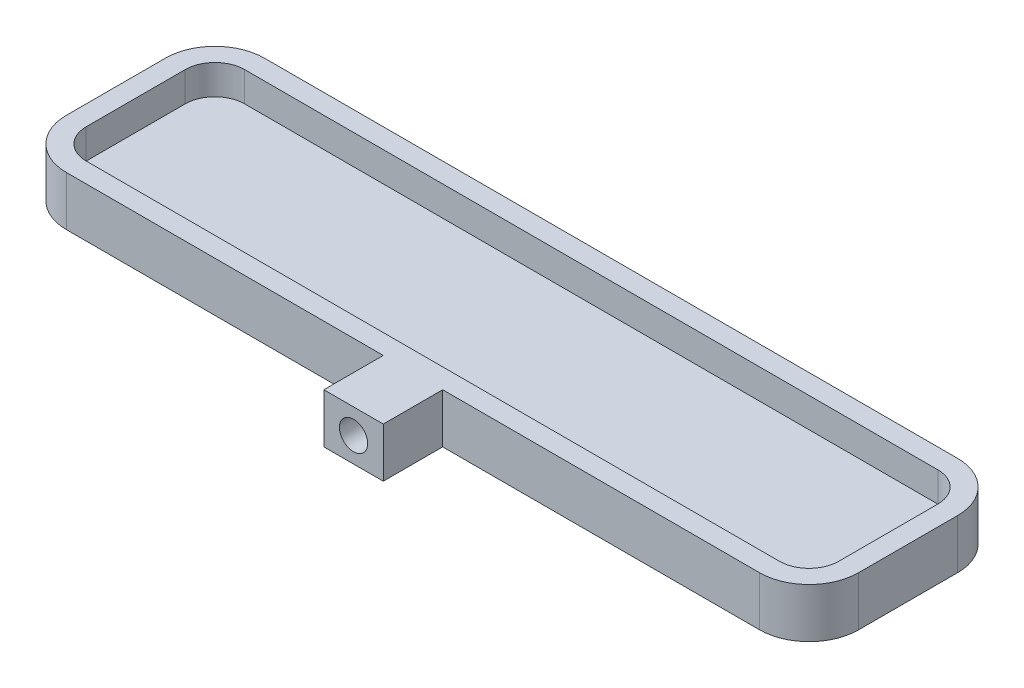
ISO-10303-21;
HEADER;
FILE_DESCRIPTION(('STEP AP214'),'2;1');
FILE_NAME('part.step','',(''),(''),'','','');
FILE_SCHEMA(('AUTOMOTIVE_DESIGN { 1 0 10303 214 1 1 1 1 }'));
ENDSEC;
DATA;
#1=APPLICATION_CONTEXT('core data for automotive mechanical design processes');
#2=APPLICATION_PROTOCOL_DEFINITION('international standard','automotive_design',2000,#1);
#3=PRODUCT_CONTEXT('',#1,'mechanical');
#4=PRODUCT('Part','Part','',(#3));
#5=PRODUCT_RELATED_PRODUCT_CATEGORY('part','',(#4));
#6=PRODUCT_DEFINITION_FORMATION('','',#4);
#7=PRODUCT_DEFINITION_CONTEXT('part definition',#1,'design');
#8=PRODUCT_DEFINITION('design','',#6,#7);
#9=PRODUCT_DEFINITION_SHAPE('','',#8);
#10=(LENGTH_UNIT() NAMED_UNIT(*) SI_UNIT(.MILLI.,.METRE.));
#11=(NAMED_UNIT(*) PLANE_ANGLE_UNIT() SI_UNIT($,.RADIAN.));
#12=(NAMED_UNIT(*) SI_UNIT($,.STERADIAN.) SOLID_ANGLE_UNIT());
#13=UNCERTAINTY_MEASURE_WITH_UNIT(LENGTH_MEASURE(1.E-05),#10,'distance_accuracy_value','');
#14=(GEOMETRIC_REPRESENTATION_CONTEXT(3) GLOBAL_UNCERTAINTY_ASSIGNED_CONTEXT((#13)) GLOBAL_UNIT_ASSIGNED_CONTEXT((#10,
#11,#12)) REPRESENTATION_CONTEXT('',''));
#15=CARTESIAN_POINT('',(0.,0.,0.));
#16=DIRECTION('',(0.,0.,1.));
#17=DIRECTION('',(1.,0.,0.));
#18=AXIS2_PLACEMENT_3D('',#15,#16,#17);
#19=CARTESIAN_POINT('',(40.,5.,9.99999999999999));
#20=DIRECTION('',(0.,0.,-1.));
#21=DIRECTION('',(-1.,0.,0.));
#22=AXIS2_PLACEMENT_3D('',#19,#20,#21);
#23=PLANE('',#22);
#24=DIRECTION('',(0.,-1.,0.));
#25=VECTOR('',#24,1.);
#26=CARTESIAN_POINT('',(-3.,0.,9.99999999999999));
#27=LINE('',#26,#25);
#28=CARTESIAN_POINT('',(-3.,5.,9.99999999999999));
#29=VERTEX_POINT('',#28);
#30=CARTESIAN_POINT('',(-3.,0.,9.99999999999999));
#31=VERTEX_POINT('',#30);
#32=EDGE_CURVE('E63',#29,#31,#27,.T.);
#33=ORIENTED_EDGE('',*,*,#32,.F.);
#34=DIRECTION('',(1.,0.,0.));
#35=VECTOR('',#34,1.);
#36=CARTESIAN_POINT('',(40.,5.,9.99999999999999));
#37=LINE('',#36,#35);
#38=CARTESIAN_POINT('',(-35.,5.,10.));
#39=VERTEX_POINT('',#38);
#40=EDGE_CURVE('E302',#39,#29,#37,.T.);
#41=ORIENTED_EDGE('',*,*,#40,.F.);
#42=DIRECTION('',(0.,-1.,0.));
#43=VECTOR('',#42,1.);
#44=CARTESIAN_POINT('',(-35.,5.,10.));
#45=LINE('',#44,#43);
#46=CARTESIAN_POINT('',(-35.,0.,10.));
#47=VERTEX_POINT('',#46);
#48=EDGE_CURVE('E347',#39,#47,#45,.T.);
#49=ORIENTED_EDGE('',*,*,#48,.T.);
#50=DIRECTION('',(1.,0.,0.));
#51=VECTOR('',#50,1.);
#52=CARTESIAN_POINT('',(40.,0.,9.99999999999999));
#53=LINE('',#52,#51);
#54=EDGE_CURVE('E318',#47,#31,#53,.T.);
#55=ORIENTED_EDGE('',*,*,#54,.T.);
#56=EDGE_LOOP('',(#33,#41,#49,#55));
#57=FACE_BOUND('',#56,.T.);
#58=ADVANCED_FACE('F39',(#57),#23,.F.);
#59=DIRECTION('',(0.,1.,0.));
#60=VECTOR('',#59,1.);
#61=CARTESIAN_POINT('',(3.,0.,9.99999999999999));
#62=LINE('',#61,#60);
#63=CARTESIAN_POINT('',(3.,0.,9.99999999999999));
#64=VERTEX_POINT('',#63);
#65=CARTESIAN_POINT('',(3.,5.,9.99999999999999));
#66=VERTEX_POINT('',#65);
#67=EDGE_CURVE('E202',#64,#66,#62,.T.);
#68=ORIENTED_EDGE('',*,*,#67,.F.);
#69=CARTESIAN_POINT('',(35.,0.,9.99999999999999));
#70=VERTEX_POINT('',#69);
#71=EDGE_CURVE('E317',#64,#70,#53,.T.);
#72=ORIENTED_EDGE('',*,*,#71,.T.);
#73=DIRECTION('',(0.,-1.,0.));
#74=VECTOR('',#73,1.);
#75=CARTESIAN_POINT('',(35.,5.,9.99999999999999));
#76=LINE('',#75,#74);
#77=CARTESIAN_POINT('',(35.,5.,9.99999999999999));
#78=VERTEX_POINT('',#77);
#79=EDGE_CURVE('E351',#70,#78,#76,.F.);
#80=ORIENTED_EDGE('',*,*,#79,.T.);
#81=EDGE_CURVE('E55',#66,#78,#37,.T.);
#82=ORIENTED_EDGE('',*,*,#81,.F.);
#83=EDGE_LOOP('',(#68,#72,#80,#82));
#84=FACE_BOUND('',#83,.T.);
#85=ADVANCED_FACE('F404',(#84),#23,.F.);
#86=CARTESIAN_POINT('',(-40.,5.,10.));
#87=DIRECTION('',(1.,0.,0.));
#88=DIRECTION('',(0.,0.,-1.));
#89=AXIS2_PLACEMENT_3D('',#86,#87,#88);
#90=PLANE('',#89);
#91=DIRECTION('',(0.,0.,1.));
#92=VECTOR('',#91,1.);
#93=CARTESIAN_POINT('',(-40.,5.,10.));
#94=LINE('',#93,#92);
#95=CARTESIAN_POINT('',(-40.,5.,-5.));
#96=VERTEX_POINT('',#95);
#97=CARTESIAN_POINT('',(-40.,5.,5.));
#98=VERTEX_POINT('',#97);
#99=EDGE_CURVE('E297',#96,#98,#94,.T.);
#100=ORIENTED_EDGE('',*,*,#99,.F.);
#101=DIRECTION('',(0.,-1.,0.));
#102=VECTOR('',#101,1.);
#103=CARTESIAN_POINT('',(-40.,5.,-5.));
#104=LINE('',#103,#102);
#105=CARTESIAN_POINT('',(-40.,0.,-5.));
#106=VERTEX_POINT('',#105);
#107=EDGE_CURVE('E11',#96,#106,#104,.T.);
#108=ORIENTED_EDGE('',*,*,#107,.T.);
#109=DIRECTION('',(0.,0.,1.));
#110=VECTOR('',#109,1.);
#111=CARTESIAN_POINT('',(-40.,0.,10.));
#112=LINE('',#111,#110);
#113=CARTESIAN_POINT('',(-40.,0.,5.));
#114=VERTEX_POINT('',#113);
#115=EDGE_CURVE('E220',#106,#114,#112,.T.);
#116=ORIENTED_EDGE('',*,*,#115,.T.);
#117=DIRECTION('',(0.,-1.,0.));
#118=VECTOR('',#117,1.);
#119=CARTESIAN_POINT('',(-40.,5.,5.));
#120=LINE('',#119,#118);
#121=EDGE_CURVE('E48',#114,#98,#120,.F.);
#122=ORIENTED_EDGE('',*,*,#121,.T.);
#123=EDGE_LOOP('',(#100,#108,#116,#122));
#124=FACE_BOUND('',#123,.T.);
#125=ADVANCED_FACE('F376',(#124),#90,.F.);
#126=CARTESIAN_POINT('',(40.,5.,9.99999999999999));
#127=DIRECTION('',(-1.,0.,0.));
#128=DIRECTION('',(0.,0.,1.));
#129=AXIS2_PLACEMENT_3D('',#126,#127,#128);
#130=PLANE('',#129);
#131=DIRECTION('',(0.,0.,-1.));
#132=VECTOR('',#131,1.);
#133=CARTESIAN_POINT('',(40.,5.,9.99999999999999));
#134=LINE('',#133,#132);
#135=CARTESIAN_POINT('',(40.,5.,4.99999999999999));
#136=VERTEX_POINT('',#135);
#137=CARTESIAN_POINT('',(40.,5.,-5.00000000000001));
#138=VERTEX_POINT('',#137);
#139=EDGE_CURVE('E305',#136,#138,#134,.T.);
#140=ORIENTED_EDGE('',*,*,#139,.F.);
#141=DIRECTION('',(0.,-1.,0.));
#142=VECTOR('',#141,1.);
#143=CARTESIAN_POINT('',(40.,5.,4.99999999999999));
#144=LINE('',#143,#142);
#145=CARTESIAN_POINT('',(40.,0.,4.99999999999999));
#146=VERTEX_POINT('',#145);
#147=EDGE_CURVE('E330',#136,#146,#144,.T.);
#148=ORIENTED_EDGE('',*,*,#147,.T.);
#149=DIRECTION('',(0.,0.,-1.));
#150=VECTOR('',#149,1.);
#151=CARTESIAN_POINT('',(40.,0.,9.99999999999999));
#152=LINE('',#151,#150);
#153=CARTESIAN_POINT('',(40.,0.,-5.00000000000001));
#154=VERTEX_POINT('',#153);
#155=EDGE_CURVE('E321',#146,#154,#152,.T.);
#156=ORIENTED_EDGE('',*,*,#155,.T.);
#157=DIRECTION('',(0.,-1.,0.));
#158=VECTOR('',#157,1.);
#159=CARTESIAN_POINT('',(40.,5.,-5.00000000000001));
#160=LINE('',#159,#158);
#161=EDGE_CURVE('E313',#154,#138,#160,.F.);
#162=ORIENTED_EDGE('',*,*,#161,.T.);
#163=EDGE_LOOP('',(#140,#148,#156,#162));
#164=FACE_BOUND('',#163,.T.);
#165=ADVANCED_FACE('F411',(#164),#130,.F.);
#166=CARTESIAN_POINT('',(40.,5.,-10.));
#167=DIRECTION('',(0.,0.,1.));
#168=DIRECTION('',(1.,0.,0.));
#169=AXIS2_PLACEMENT_3D('',#166,#167,#168);
#170=PLANE('',#169);
#171=DIRECTION('',(-1.,0.,0.));
#172=VECTOR('',#171,1.);
#173=CARTESIAN_POINT('',(40.,5.,-10.));
#174=LINE('',#173,#172);
#175=CARTESIAN_POINT('',(35.,5.,-10.));
#176=VERTEX_POINT('',#175);
#177=CARTESIAN_POINT('',(-35.,5.,-10.));
#178=VERTEX_POINT('',#177);
#179=EDGE_CURVE('E309',#176,#178,#174,.T.);
#180=ORIENTED_EDGE('',*,*,#179,.F.);
#181=DIRECTION('',(0.,-1.,0.));
#182=VECTOR('',#181,1.);
#183=CARTESIAN_POINT('',(35.,5.,-10.));
#184=LINE('',#183,#182);
#185=CARTESIAN_POINT('',(35.,0.,-10.));
#186=VERTEX_POINT('',#185);
#187=EDGE_CURVE('E369',#176,#186,#184,.T.);
#188=ORIENTED_EDGE('',*,*,#187,.T.);
#189=DIRECTION('',(-1.,0.,0.));
#190=VECTOR('',#189,1.);
#191=CARTESIAN_POINT('',(40.,0.,-10.));
#192=LINE('',#191,#190);
#193=CARTESIAN_POINT('',(-35.,0.,-10.));
#194=VERTEX_POINT('',#193);
#195=EDGE_CURVE('E301',#186,#194,#192,.T.);
#196=ORIENTED_EDGE('',*,*,#195,.T.);
#197=DIRECTION('',(0.,-1.,0.));
#198=VECTOR('',#197,1.);
#199=CARTESIAN_POINT('',(-35.,5.,-10.));
#200=LINE('',#199,#198);
#201=EDGE_CURVE('E366',#194,#178,#200,.F.);
#202=ORIENTED_EDGE('',*,*,#201,.T.);
#203=EDGE_LOOP('',(#180,#188,#196,#202));
#204=FACE_BOUND('',#203,.T.);
#205=ADVANCED_FACE('F390',(#204),#170,.F.);
#206=CARTESIAN_POINT('',(0.,5.,0.));
#207=DIRECTION('',(0.,1.,0.));
#208=DIRECTION('',(0.,0.,1.));
#209=AXIS2_PLACEMENT_3D('',#206,#207,#208);
#210=PLANE('',#209);
#211=DIRECTION('',(1.,0.,0.));
#212=VECTOR('',#211,1.);
#213=CARTESIAN_POINT('',(40.,5.,7.99999999999999));
#214=LINE('',#213,#212);
#215=CARTESIAN_POINT('',(-35.,5.,8.));
#216=VERTEX_POINT('',#215);
#217=CARTESIAN_POINT('',(35.,5.,7.99999999999999));
#218=VERTEX_POINT('',#217);
#219=EDGE_CURVE('E276',#216,#218,#214,.T.);
#220=ORIENTED_EDGE('',*,*,#219,.F.);
#221=CARTESIAN_POINT('',(-35.,5.,5.));
#222=DIRECTION('',(0.,1.,0.));
#223=DIRECTION('',(0.,0.,1.));
#224=AXIS2_PLACEMENT_3D('',#221,#222,#223);
#225=CIRCLE('',#224,3.);
#226=CARTESIAN_POINT('',(-38.,5.,5.));
#227=VERTEX_POINT('',#226);
#228=EDGE_CURVE('E256',#227,#216,#225,.T.);
#229=ORIENTED_EDGE('',*,*,#228,.F.);
#230=DIRECTION('',(0.,0.,1.));
#231=VECTOR('',#230,1.);
#232=CARTESIAN_POINT('',(-38.,5.,10.));
#233=LINE('',#232,#231);
#234=CARTESIAN_POINT('',(-38.,5.,-5.));
#235=VERTEX_POINT('',#234);
#236=EDGE_CURVE('E250',#235,#227,#233,.T.);
#237=ORIENTED_EDGE('',*,*,#236,.F.);
#238=CARTESIAN_POINT('',(-35.,5.,-5.));
#239=DIRECTION('',(0.,1.,0.));
#240=DIRECTION('',(0.,0.,1.));
#241=AXIS2_PLACEMENT_3D('',#238,#239,#240);
#242=CIRCLE('',#241,3.);
#243=CARTESIAN_POINT('',(-35.,5.,-8.));
#244=VERTEX_POINT('',#243);
#245=EDGE_CURVE('E279',#244,#235,#242,.T.);
#246=ORIENTED_EDGE('',*,*,#245,.F.);
#247=DIRECTION('',(-1.,0.,0.));
#248=VECTOR('',#247,1.);
#249=CARTESIAN_POINT('',(40.,5.,-8.00000000000001));
#250=LINE('',#249,#248);
#251=CARTESIAN_POINT('',(35.,5.,-8.00000000000001));
#252=VERTEX_POINT('',#251);
#253=EDGE_CURVE('E266',#252,#244,#250,.T.);
#254=ORIENTED_EDGE('',*,*,#253,.F.);
#255=CARTESIAN_POINT('',(35.,5.,-5.00000000000001));
#256=DIRECTION('',(0.,1.,0.));
#257=DIRECTION('',(0.,0.,1.));
#258=AXIS2_PLACEMENT_3D('',#255,#256,#257);
#259=CIRCLE('',#258,3.);
#260=CARTESIAN_POINT('',(38.,5.,-5.00000000000001));
#261=VERTEX_POINT('',#260);
#262=EDGE_CURVE('E286',#261,#252,#259,.T.);
#263=ORIENTED_EDGE('',*,*,#262,.F.);
#264=DIRECTION('',(0.,0.,-1.));
#265=VECTOR('',#264,1.);
#266=CARTESIAN_POINT('',(38.,5.,9.99999999999999));
#267=LINE('',#266,#265);
#268=CARTESIAN_POINT('',(38.,5.,4.99999999999999));
#269=VERTEX_POINT('',#268);
#270=EDGE_CURVE('E283',#269,#261,#267,.T.);
#271=ORIENTED_EDGE('',*,*,#270,.F.);
#272=CARTESIAN_POINT('',(35.,5.,4.99999999999999));
#273=DIRECTION('',(0.,1.,0.));
#274=DIRECTION('',(0.,0.,1.));
#275=AXIS2_PLACEMENT_3D('',#272,#273,#274);
#276=CIRCLE('',#275,3.);
#277=EDGE_CURVE('E273',#218,#269,#276,.T.);
#278=ORIENTED_EDGE('',*,*,#277,.F.);
#279=EDGE_LOOP('',(#220,#229,#237,#246,#254,#263,#271,#278));
#280=FACE_BOUND('',#279,.T.);
#281=ORIENTED_EDGE('',*,*,#40,.T.);
#282=DIRECTION('',(0.,0.,-1.));
#283=VECTOR('',#282,1.);
#284=CARTESIAN_POINT('',(-3.,5.,16.));
#285=LINE('',#284,#283);
#286=CARTESIAN_POINT('',(-3.,5.,16.));
#287=VERTEX_POINT('',#286);
#288=EDGE_CURVE('E438',#287,#29,#285,.T.);
#289=ORIENTED_EDGE('',*,*,#288,.F.);
#290=DIRECTION('',(-1.,0.,0.));
#291=VECTOR('',#290,1.);
#292=CARTESIAN_POINT('',(3.,5.,16.));
#293=LINE('',#292,#291);
#294=CARTESIAN_POINT('',(3.,5.,16.));
#295=VERTEX_POINT('',#294);
#296=EDGE_CURVE('E197',#295,#287,#293,.T.);
#297=ORIENTED_EDGE('',*,*,#296,.F.);
#298=DIRECTION('',(0.,0.,-1.));
#299=VECTOR('',#298,1.);
#300=CARTESIAN_POINT('',(3.,5.,16.));
#301=LINE('',#300,#299);
#302=EDGE_CURVE('E213',#295,#66,#301,.T.);
#303=ORIENTED_EDGE('',*,*,#302,.T.);
#304=ORIENTED_EDGE('',*,*,#81,.T.);
#305=CARTESIAN_POINT('',(35.,5.,4.99999999999999));
#306=DIRECTION('',(0.,1.,0.));
#307=DIRECTION('',(0.,0.,1.));
#308=AXIS2_PLACEMENT_3D('',#305,#306,#307);
#309=CIRCLE('',#308,5.);
#310=EDGE_CURVE('E363',#78,#136,#309,.T.);
#311=ORIENTED_EDGE('',*,*,#310,.T.);
#312=ORIENTED_EDGE('',*,*,#139,.T.);
#313=CARTESIAN_POINT('',(35.,5.,-5.00000000000001));
#314=DIRECTION('',(0.,1.,0.));
#315=DIRECTION('',(0.,0.,1.));
#316=AXIS2_PLACEMENT_3D('',#313,#314,#315);
#317=CIRCLE('',#316,5.);
#318=EDGE_CURVE('E360',#138,#176,#317,.T.);
#319=ORIENTED_EDGE('',*,*,#318,.T.);
#320=ORIENTED_EDGE('',*,*,#179,.T.);
#321=CARTESIAN_POINT('',(-35.,5.,-5.));
#322=DIRECTION('',(0.,1.,0.));
#323=DIRECTION('',(0.,0.,1.));
#324=AXIS2_PLACEMENT_3D('',#321,#322,#323);
#325=CIRCLE('',#324,5.);
#326=EDGE_CURVE('E357',#178,#96,#325,.T.);
#327=ORIENTED_EDGE('',*,*,#326,.T.);
#328=ORIENTED_EDGE('',*,*,#99,.T.);
#329=CARTESIAN_POINT('',(-35.,5.,5.));
#330=DIRECTION('',(0.,1.,0.));
#331=DIRECTION('',(0.,0.,1.));
#332=AXIS2_PLACEMENT_3D('',#329,#330,#331);
#333=CIRCLE('',#332,5.);
#334=EDGE_CURVE('E354',#98,#39,#333,.T.);
#335=ORIENTED_EDGE('',*,*,#334,.T.);
#336=EDGE_LOOP('',(#281,#289,#297,#303,#304,#311,#312,#319,#320,#327,#328,#335));
#337=FACE_BOUND('',#336,.T.);
#338=ADVANCED_FACE('F382',(#280,#337),#210,.T.);
#339=CARTESIAN_POINT('',(0.,0.,0.));
#340=DIRECTION('',(0.,1.,0.));
#341=DIRECTION('',(0.,0.,1.));
#342=AXIS2_PLACEMENT_3D('',#339,#340,#341);
#343=PLANE('',#342);
#344=ORIENTED_EDGE('',*,*,#155,.F.);
#345=CARTESIAN_POINT('',(35.,0.,4.99999999999999));
#346=DIRECTION('',(0.,1.,0.));
#347=DIRECTION('',(0.,0.,1.));
#348=AXIS2_PLACEMENT_3D('',#345,#346,#347);
#349=CIRCLE('',#348,5.);
#350=EDGE_CURVE('E343',#146,#70,#349,.F.);
#351=ORIENTED_EDGE('',*,*,#350,.T.);
#352=ORIENTED_EDGE('',*,*,#71,.F.);
#353=DIRECTION('',(0.,0.,-1.));
#354=VECTOR('',#353,1.);
#355=CARTESIAN_POINT('',(3.,0.,16.));
#356=LINE('',#355,#354);
#357=CARTESIAN_POINT('',(3.,0.,16.));
#358=VERTEX_POINT('',#357);
#359=EDGE_CURVE('E187',#358,#64,#356,.T.);
#360=ORIENTED_EDGE('',*,*,#359,.F.);
#361=DIRECTION('',(1.,0.,0.));
#362=VECTOR('',#361,1.);
#363=CARTESIAN_POINT('',(3.,0.,16.));
#364=LINE('',#363,#362);
#365=CARTESIAN_POINT('',(-3.,0.,16.));
#366=VERTEX_POINT('',#365);
#367=EDGE_CURVE('E179',#366,#358,#364,.T.);
#368=ORIENTED_EDGE('',*,*,#367,.F.);
#369=DIRECTION('',(0.,0.,-1.));
#370=VECTOR('',#369,1.);
#371=CARTESIAN_POINT('',(-3.,0.,16.));
#372=LINE('',#371,#370);
#373=EDGE_CURVE('E185',#366,#31,#372,.T.);
#374=ORIENTED_EDGE('',*,*,#373,.T.);
#375=ORIENTED_EDGE('',*,*,#54,.F.);
#376=CARTESIAN_POINT('',(-35.,0.,5.));
#377=DIRECTION('',(0.,1.,0.));
#378=DIRECTION('',(0.,0.,1.));
#379=AXIS2_PLACEMENT_3D('',#376,#377,#378);
#380=CIRCLE('',#379,5.);
#381=EDGE_CURVE('E334',#47,#114,#380,.F.);
#382=ORIENTED_EDGE('',*,*,#381,.T.);
#383=ORIENTED_EDGE('',*,*,#115,.F.);
#384=CARTESIAN_POINT('',(-35.,0.,-5.));
#385=DIRECTION('',(0.,1.,0.));
#386=DIRECTION('',(0.,0.,1.));
#387=AXIS2_PLACEMENT_3D('',#384,#385,#386);
#388=CIRCLE('',#387,5.);
#389=EDGE_CURVE('E337',#106,#194,#388,.F.);
#390=ORIENTED_EDGE('',*,*,#389,.T.);
#391=ORIENTED_EDGE('',*,*,#195,.F.);
#392=CARTESIAN_POINT('',(35.,0.,-5.00000000000001));
#393=DIRECTION('',(0.,1.,0.));
#394=DIRECTION('',(0.,0.,1.));
#395=AXIS2_PLACEMENT_3D('',#392,#393,#394);
#396=CIRCLE('',#395,5.);
#397=EDGE_CURVE('E340',#186,#154,#396,.F.);
#398=ORIENTED_EDGE('',*,*,#397,.T.);
#399=EDGE_LOOP('',(#344,#351,#352,#360,#368,#374,#375,#382,#383,#390,#391,#398));
#400=FACE_BOUND('',#399,.T.);
#401=ADVANCED_FACE('F182',(#400),#343,.F.);
#402=CARTESIAN_POINT('',(35.,5.,4.99999999999999));
#403=DIRECTION('',(0.,-1.,0.));
#404=DIRECTION('',(0.,0.,-1.));
#405=AXIS2_PLACEMENT_3D('',#402,#403,#404);
#406=CYLINDRICAL_SURFACE('',#405,5.);
#407=ORIENTED_EDGE('',*,*,#310,.F.);
#408=ORIENTED_EDGE('',*,*,#79,.F.);
#409=ORIENTED_EDGE('',*,*,#350,.F.);
#410=ORIENTED_EDGE('',*,*,#147,.F.);
#411=EDGE_LOOP('',(#407,#408,#409,#410));
#412=FACE_BOUND('',#411,.T.);
#413=ADVANCED_FACE('F400',(#412),#406,.T.);
#414=CARTESIAN_POINT('',(35.,5.,-5.00000000000001));
#415=DIRECTION('',(0.,-1.,0.));
#416=DIRECTION('',(0.,0.,-1.));
#417=AXIS2_PLACEMENT_3D('',#414,#415,#416);
#418=CYLINDRICAL_SURFACE('',#417,5.);
#419=ORIENTED_EDGE('',*,*,#318,.F.);
#420=ORIENTED_EDGE('',*,*,#161,.F.);
#421=ORIENTED_EDGE('',*,*,#397,.F.);
#422=ORIENTED_EDGE('',*,*,#187,.F.);
#423=EDGE_LOOP('',(#419,#420,#421,#422));
#424=FACE_BOUND('',#423,.T.);
#425=ADVANCED_FACE('F394',(#424),#418,.T.);
#426=CARTESIAN_POINT('',(-35.,5.,-5.));
#427=DIRECTION('',(0.,-1.,0.));
#428=DIRECTION('',(0.,0.,-1.));
#429=AXIS2_PLACEMENT_3D('',#426,#427,#428);
#430=CYLINDRICAL_SURFACE('',#429,5.);
#431=ORIENTED_EDGE('',*,*,#326,.F.);
#432=ORIENTED_EDGE('',*,*,#201,.F.);
#433=ORIENTED_EDGE('',*,*,#389,.F.);
#434=ORIENTED_EDGE('',*,*,#107,.F.);
#435=EDGE_LOOP('',(#431,#432,#433,#434));
#436=FACE_BOUND('',#435,.T.);
#437=ADVANCED_FACE('F392',(#436),#430,.T.);
#438=CARTESIAN_POINT('',(-35.,5.,5.));
#439=DIRECTION('',(0.,-1.,0.));
#440=DIRECTION('',(0.,0.,-1.));
#441=AXIS2_PLACEMENT_3D('',#438,#439,#440);
#442=CYLINDRICAL_SURFACE('',#441,5.);
#443=ORIENTED_EDGE('',*,*,#334,.F.);
#444=ORIENTED_EDGE('',*,*,#121,.F.);
#445=ORIENTED_EDGE('',*,*,#381,.F.);
#446=ORIENTED_EDGE('',*,*,#48,.F.);
#447=EDGE_LOOP('',(#443,#444,#445,#446));
#448=FACE_BOUND('',#447,.T.);
#449=ADVANCED_FACE('F41',(#448),#442,.T.);
#450=CARTESIAN_POINT('',(-38.,5.,10.));
#451=DIRECTION('',(1.,0.,0.));
#452=DIRECTION('',(0.,0.,-1.));
#453=AXIS2_PLACEMENT_3D('',#450,#451,#452);
#454=PLANE('',#453);
#455=ORIENTED_EDGE('',*,*,#236,.T.);
#456=DIRECTION('',(0.,1.,0.));
#457=VECTOR('',#456,1.);
#458=CARTESIAN_POINT('',(-38.,5.,5.));
#459=LINE('',#458,#457);
#460=CARTESIAN_POINT('',(-38.,2.,5.));
#461=VERTEX_POINT('',#460);
#462=EDGE_CURVE('E221',#461,#227,#459,.T.);
#463=ORIENTED_EDGE('',*,*,#462,.F.);
#464=DIRECTION('',(0.,0.,1.));
#465=VECTOR('',#464,1.);
#466=CARTESIAN_POINT('',(-38.,2.,10.));
#467=LINE('',#466,#465);
#468=CARTESIAN_POINT('',(-38.,2.,-5.));
#469=VERTEX_POINT('',#468);
#470=EDGE_CURVE('E206',#469,#461,#467,.T.);
#471=ORIENTED_EDGE('',*,*,#470,.F.);
#472=DIRECTION('',(0.,1.,0.));
#473=VECTOR('',#472,1.);
#474=CARTESIAN_POINT('',(-38.,5.,-5.));
#475=LINE('',#474,#473);
#476=EDGE_CURVE('E217',#235,#469,#475,.F.);
#477=ORIENTED_EDGE('',*,*,#476,.F.);
#478=EDGE_LOOP('',(#455,#463,#471,#477));
#479=FACE_BOUND('',#478,.T.);
#480=ADVANCED_FACE('F399',(#479),#454,.T.);
#481=CARTESIAN_POINT('',(40.,5.,7.99999999999999));
#482=DIRECTION('',(0.,0.,-1.));
#483=DIRECTION('',(-1.,0.,0.));
#484=AXIS2_PLACEMENT_3D('',#481,#482,#483);
#485=PLANE('',#484);
#486=DIRECTION('',(1.,0.,0.));
#487=VECTOR('',#486,1.);
#488=CARTESIAN_POINT('',(40.,2.,7.99999999999999));
#489=LINE('',#488,#487);
#490=CARTESIAN_POINT('',(-35.,2.,8.));
#491=VERTEX_POINT('',#490);
#492=CARTESIAN_POINT('',(35.,2.,7.99999999999999));
#493=VERTEX_POINT('',#492);
#494=EDGE_CURVE('E211',#491,#493,#489,.T.);
#495=ORIENTED_EDGE('',*,*,#494,.F.);
#496=DIRECTION('',(0.,1.,0.));
#497=VECTOR('',#496,1.);
#498=CARTESIAN_POINT('',(-35.,5.,8.));
#499=LINE('',#498,#497);
#500=EDGE_CURVE('E235',#216,#491,#499,.F.);
#501=ORIENTED_EDGE('',*,*,#500,.F.);
#502=ORIENTED_EDGE('',*,*,#219,.T.);
#503=DIRECTION('',(0.,1.,0.));
#504=VECTOR('',#503,1.);
#505=CARTESIAN_POINT('',(35.,5.,7.99999999999999));
#506=LINE('',#505,#504);
#507=EDGE_CURVE('E253',#493,#218,#506,.T.);
#508=ORIENTED_EDGE('',*,*,#507,.F.);
#509=EDGE_LOOP('',(#495,#501,#502,#508));
#510=FACE_BOUND('',#509,.T.);
#511=ADVANCED_FACE('F476',(#510),#485,.T.);
#512=CARTESIAN_POINT('',(38.,5.,9.99999999999999));
#513=DIRECTION('',(-1.,0.,0.));
#514=DIRECTION('',(0.,0.,1.));
#515=AXIS2_PLACEMENT_3D('',#512,#513,#514);
#516=PLANE('',#515);
#517=ORIENTED_EDGE('',*,*,#270,.T.);
#518=DIRECTION('',(0.,1.,0.));
#519=VECTOR('',#518,1.);
#520=CARTESIAN_POINT('',(38.,5.,-5.00000000000001));
#521=LINE('',#520,#519);
#522=CARTESIAN_POINT('',(38.,2.,-5.00000000000001));
#523=VERTEX_POINT('',#522);
#524=EDGE_CURVE('E263',#523,#261,#521,.T.);
#525=ORIENTED_EDGE('',*,*,#524,.F.);
#526=DIRECTION('',(0.,0.,-1.));
#527=VECTOR('',#526,1.);
#528=CARTESIAN_POINT('',(38.,2.,9.99999999999999));
#529=LINE('',#528,#527);
#530=CARTESIAN_POINT('',(38.,2.,4.99999999999999));
#531=VERTEX_POINT('',#530);
#532=EDGE_CURVE('E227',#531,#523,#529,.T.);
#533=ORIENTED_EDGE('',*,*,#532,.F.);
#534=DIRECTION('',(0.,1.,0.));
#535=VECTOR('',#534,1.);
#536=CARTESIAN_POINT('',(38.,5.,4.99999999999999));
#537=LINE('',#536,#535);
#538=EDGE_CURVE('E244',#269,#531,#537,.F.);
#539=ORIENTED_EDGE('',*,*,#538,.F.);
#540=EDGE_LOOP('',(#517,#525,#533,#539));
#541=FACE_BOUND('',#540,.T.);
#542=ADVANCED_FACE('F480',(#541),#516,.T.);
#543=CARTESIAN_POINT('',(40.,5.,-8.00000000000001));
#544=DIRECTION('',(0.,0.,1.));
#545=DIRECTION('',(1.,0.,0.));
#546=AXIS2_PLACEMENT_3D('',#543,#544,#545);
#547=PLANE('',#546);
#548=ORIENTED_EDGE('',*,*,#253,.T.);
#549=DIRECTION('',(0.,1.,0.));
#550=VECTOR('',#549,1.);
#551=CARTESIAN_POINT('',(-35.,5.,-8.));
#552=LINE('',#551,#550);
#553=CARTESIAN_POINT('',(-35.,2.,-8.));
#554=VERTEX_POINT('',#553);
#555=EDGE_CURVE('E270',#554,#244,#552,.T.);
#556=ORIENTED_EDGE('',*,*,#555,.F.);
#557=DIRECTION('',(-1.,0.,0.));
#558=VECTOR('',#557,1.);
#559=CARTESIAN_POINT('',(40.,2.,-8.00000000000001));
#560=LINE('',#559,#558);
#561=CARTESIAN_POINT('',(35.,2.,-8.00000000000001));
#562=VERTEX_POINT('',#561);
#563=EDGE_CURVE('E231',#562,#554,#560,.T.);
#564=ORIENTED_EDGE('',*,*,#563,.F.);
#565=DIRECTION('',(0.,1.,0.));
#566=VECTOR('',#565,1.);
#567=CARTESIAN_POINT('',(35.,5.,-8.00000000000001));
#568=LINE('',#567,#566);
#569=EDGE_CURVE('E226',#252,#562,#568,.F.);
#570=ORIENTED_EDGE('',*,*,#569,.F.);
#571=EDGE_LOOP('',(#548,#556,#564,#570));
#572=FACE_BOUND('',#571,.T.);
#573=ADVANCED_FACE('F484',(#572),#547,.T.);
#574=CARTESIAN_POINT('',(0.,2.,0.));
#575=DIRECTION('',(0.,1.,0.));
#576=DIRECTION('',(0.,0.,1.));
#577=AXIS2_PLACEMENT_3D('',#574,#575,#576);
#578=PLANE('',#577);
#579=ORIENTED_EDGE('',*,*,#532,.T.);
#580=CARTESIAN_POINT('',(35.,2.,-5.00000000000001));
#581=DIRECTION('',(0.,1.,0.));
#582=DIRECTION('',(0.,0.,1.));
#583=AXIS2_PLACEMENT_3D('',#580,#581,#582);
#584=CIRCLE('',#583,3.);
#585=EDGE_CURVE('E236',#562,#523,#584,.F.);
#586=ORIENTED_EDGE('',*,*,#585,.F.);
#587=ORIENTED_EDGE('',*,*,#563,.T.);
#588=CARTESIAN_POINT('',(-35.,2.,-5.));
#589=DIRECTION('',(0.,1.,0.));
#590=DIRECTION('',(0.,0.,1.));
#591=AXIS2_PLACEMENT_3D('',#588,#589,#590);
#592=CIRCLE('',#591,3.);
#593=EDGE_CURVE('E243',#469,#554,#592,.F.);
#594=ORIENTED_EDGE('',*,*,#593,.F.);
#595=ORIENTED_EDGE('',*,*,#470,.T.);
#596=CARTESIAN_POINT('',(-35.,2.,5.));
#597=DIRECTION('',(0.,1.,0.));
#598=DIRECTION('',(0.,0.,1.));
#599=AXIS2_PLACEMENT_3D('',#596,#597,#598);
#600=CIRCLE('',#599,3.);
#601=EDGE_CURVE('E240',#491,#461,#600,.F.);
#602=ORIENTED_EDGE('',*,*,#601,.F.);
#603=ORIENTED_EDGE('',*,*,#494,.T.);
#604=CARTESIAN_POINT('',(35.,2.,4.99999999999999));
#605=DIRECTION('',(0.,1.,0.));
#606=DIRECTION('',(0.,0.,1.));
#607=AXIS2_PLACEMENT_3D('',#604,#605,#606);
#608=CIRCLE('',#607,3.);
#609=EDGE_CURVE('E232',#531,#493,#608,.F.);
#610=ORIENTED_EDGE('',*,*,#609,.F.);
#611=EDGE_LOOP('',(#579,#586,#587,#594,#595,#602,#603,#610));
#612=FACE_BOUND('',#611,.T.);
#613=ADVANCED_FACE('F488',(#612),#578,.T.);
#614=CARTESIAN_POINT('',(35.,5.,4.99999999999999));
#615=DIRECTION('',(0.,-1.,0.));
#616=DIRECTION('',(0.,0.,-1.));
#617=AXIS2_PLACEMENT_3D('',#614,#615,#616);
#618=CYLINDRICAL_SURFACE('',#617,3.);
#619=ORIENTED_EDGE('',*,*,#277,.T.);
#620=ORIENTED_EDGE('',*,*,#538,.T.);
#621=ORIENTED_EDGE('',*,*,#609,.T.);
#622=ORIENTED_EDGE('',*,*,#507,.T.);
#623=EDGE_LOOP('',(#619,#620,#621,#622));
#624=FACE_BOUND('',#623,.T.);
#625=ADVANCED_FACE('F492',(#624),#618,.F.);
#626=CARTESIAN_POINT('',(35.,5.,-5.00000000000001));
#627=DIRECTION('',(0.,-1.,0.));
#628=DIRECTION('',(0.,0.,-1.));
#629=AXIS2_PLACEMENT_3D('',#626,#627,#628);
#630=CYLINDRICAL_SURFACE('',#629,3.);
#631=ORIENTED_EDGE('',*,*,#262,.T.);
#632=ORIENTED_EDGE('',*,*,#569,.T.);
#633=ORIENTED_EDGE('',*,*,#585,.T.);
#634=ORIENTED_EDGE('',*,*,#524,.T.);
#635=EDGE_LOOP('',(#631,#632,#633,#634));
#636=FACE_BOUND('',#635,.T.);
#637=ADVANCED_FACE('F496',(#636),#630,.F.);
#638=CARTESIAN_POINT('',(-35.,5.,-5.));
#639=DIRECTION('',(0.,-1.,0.));
#640=DIRECTION('',(0.,0.,-1.));
#641=AXIS2_PLACEMENT_3D('',#638,#639,#640);
#642=CYLINDRICAL_SURFACE('',#641,3.);
#643=ORIENTED_EDGE('',*,*,#245,.T.);
#644=ORIENTED_EDGE('',*,*,#476,.T.);
#645=ORIENTED_EDGE('',*,*,#593,.T.);
#646=ORIENTED_EDGE('',*,*,#555,.T.);
#647=EDGE_LOOP('',(#643,#644,#645,#646));
#648=FACE_BOUND('',#647,.T.);
#649=ADVANCED_FACE('F500',(#648),#642,.F.);
#650=CARTESIAN_POINT('',(-35.,5.,5.));
#651=DIRECTION('',(0.,-1.,0.));
#652=DIRECTION('',(0.,0.,-1.));
#653=AXIS2_PLACEMENT_3D('',#650,#651,#652);
#654=CYLINDRICAL_SURFACE('',#653,3.);
#655=ORIENTED_EDGE('',*,*,#228,.T.);
#656=ORIENTED_EDGE('',*,*,#500,.T.);
#657=ORIENTED_EDGE('',*,*,#601,.T.);
#658=ORIENTED_EDGE('',*,*,#462,.T.);
#659=EDGE_LOOP('',(#655,#656,#657,#658));
#660=FACE_BOUND('',#659,.T.);
#661=ADVANCED_FACE('F473',(#660),#654,.F.);
#662=CARTESIAN_POINT('',(-3.,0.,16.));
#663=DIRECTION('',(1.,0.,0.));
#664=DIRECTION('',(0.,0.,-1.));
#665=AXIS2_PLACEMENT_3D('',#662,#663,#664);
#666=PLANE('',#665);
#667=ORIENTED_EDGE('',*,*,#32,.T.);
#668=ORIENTED_EDGE('',*,*,#373,.F.);
#669=DIRECTION('',(0.,-1.,0.));
#670=VECTOR('',#669,1.);
#671=CARTESIAN_POINT('',(-3.,0.,16.));
#672=LINE('',#671,#670);
#673=EDGE_CURVE('E192',#287,#366,#672,.T.);
#674=ORIENTED_EDGE('',*,*,#673,.F.);
#675=ORIENTED_EDGE('',*,*,#288,.T.);
#676=EDGE_LOOP('',(#667,#668,#674,#675));
#677=FACE_BOUND('',#676,.T.);
#678=ADVANCED_FACE('F204',(#677),#666,.F.);
#679=CARTESIAN_POINT('',(3.,0.,16.));
#680=DIRECTION('',(-1.,0.,0.));
#681=DIRECTION('',(0.,0.,1.));
#682=AXIS2_PLACEMENT_3D('',#679,#680,#681);
#683=PLANE('',#682);
#684=ORIENTED_EDGE('',*,*,#67,.T.);
#685=ORIENTED_EDGE('',*,*,#302,.F.);
#686=DIRECTION('',(0.,1.,0.));
#687=VECTOR('',#686,1.);
#688=CARTESIAN_POINT('',(3.,0.,16.));
#689=LINE('',#688,#687);
#690=EDGE_CURVE('E191',#358,#295,#689,.T.);
#691=ORIENTED_EDGE('',*,*,#690,.F.);
#692=ORIENTED_EDGE('',*,*,#359,.T.);
#693=EDGE_LOOP('',(#684,#685,#691,#692));
#694=FACE_BOUND('',#693,.T.);
#695=ADVANCED_FACE('F434',(#694),#683,.F.);
#696=CARTESIAN_POINT('',(0.,0.,16.));
#697=DIRECTION('',(0.,0.,1.));
#698=DIRECTION('',(1.,0.,0.));
#699=AXIS2_PLACEMENT_3D('',#696,#697,#698);
#700=PLANE('',#699);
#701=CARTESIAN_POINT('',(0.,2.5,16.));
#702=DIRECTION('',(0.,0.,1.));
#703=DIRECTION('',(1.,0.,0.));
#704=AXIS2_PLACEMENT_3D('',#701,#702,#703);
#705=CIRCLE('',#704,1.425);
#706=CARTESIAN_POINT('',(1.425,2.5,16.));
#707=VERTEX_POINT('',#706);
#708=EDGE_CURVE('E448',#707,#707,#705,.T.);
#709=ORIENTED_EDGE('',*,*,#708,.F.);
#710=EDGE_LOOP('',(#709));
#711=FACE_BOUND('',#710,.T.);
#712=ORIENTED_EDGE('',*,*,#673,.T.);
#713=ORIENTED_EDGE('',*,*,#367,.T.);
#714=ORIENTED_EDGE('',*,*,#690,.T.);
#715=ORIENTED_EDGE('',*,*,#296,.T.);
#716=EDGE_LOOP('',(#712,#713,#714,#715));
#717=FACE_BOUND('',#716,.T.);
#718=ADVANCED_FACE('F195',(#711,#717),#700,.T.);
#719=CARTESIAN_POINT('',(0.,2.5,12.));
#720=DIRECTION('',(0.,0.,1.));
#721=DIRECTION('',(1.,0.,0.));
#722=AXIS2_PLACEMENT_3D('',#719,#720,#721);
#723=CYLINDRICAL_SURFACE('',#722,1.425);
#724=CARTESIAN_POINT('',(0.,2.5,12.));
#725=DIRECTION('',(0.,0.,1.));
#726=DIRECTION('',(1.,0.,0.));
#727=AXIS2_PLACEMENT_3D('',#724,#725,#726);
#728=CIRCLE('',#727,1.425);
#729=CARTESIAN_POINT('',(1.425,2.5,12.));
#730=VERTEX_POINT('',#729);
#731=EDGE_CURVE('E442',#730,#730,#728,.T.);
#732=ORIENTED_EDGE('',*,*,#731,.F.);
#733=EDGE_LOOP('',(#732));
#734=FACE_BOUND('',#733,.T.);
#735=ORIENTED_EDGE('',*,*,#708,.T.);
#736=EDGE_LOOP('',(#735));
#737=FACE_BOUND('',#736,.T.);
#738=ADVANCED_FACE('F457',(#734,#737),#723,.F.);
#739=CARTESIAN_POINT('',(0.,2.5,12.));
#740=DIRECTION('',(0.,0.,1.));
#741=DIRECTION('',(1.,0.,0.));
#742=AXIS2_PLACEMENT_3D('',#739,#740,#741);
#743=PLANE('',#742);
#744=ORIENTED_EDGE('',*,*,#731,.T.);
#745=EDGE_LOOP('',(#744));
#746=FACE_BOUND('',#745,.T.);
#747=ADVANCED_FACE('F465',(#746),#743,.T.);
#748=CLOSED_SHELL('',(#58,#85,#125,#165,#205,#338,#401,#413,#425,#437,#449,#480,#511,#542,#573,
#613,#625,#637,#649,#661,#678,#695,#718,#738,#747));
#749=MANIFOLD_SOLID_BREP('B2',#748);
#750=ADVANCED_BREP_SHAPE_REPRESENTATION('',(#18,#749),#14);
#751=SHAPE_DEFINITION_REPRESENTATION(#9,#750);
ENDSEC;
END-ISO-10303-21;
